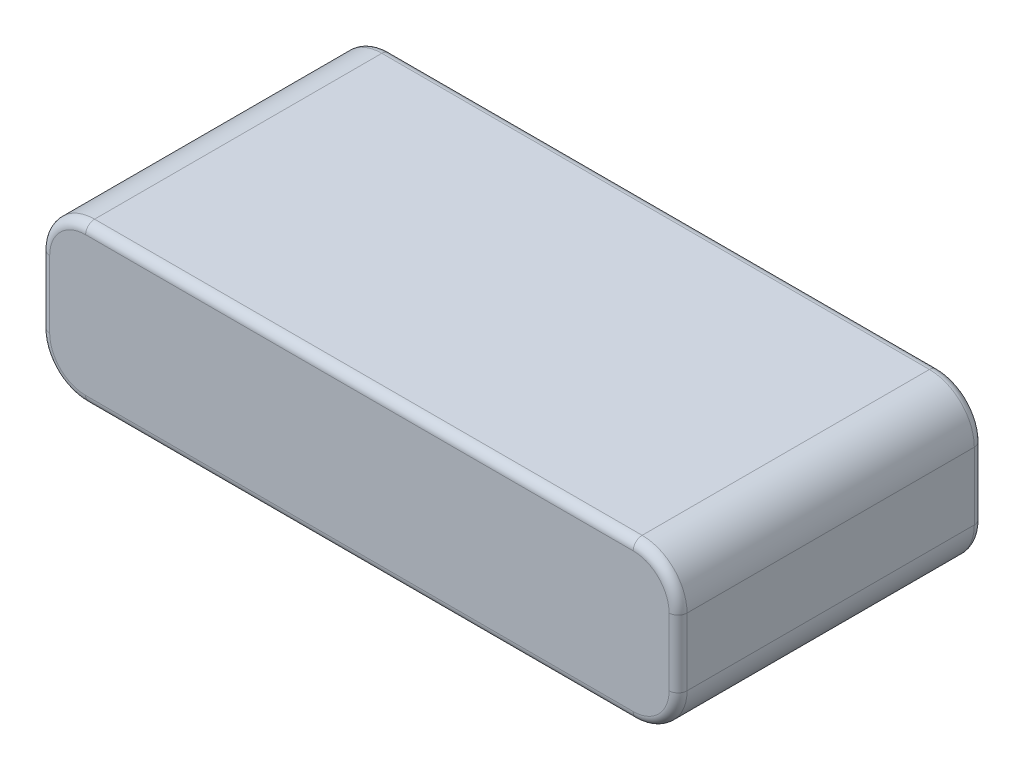
ISO-10303-21;
HEADER;
FILE_DESCRIPTION(('STEP AP214'),'2;1');
FILE_NAME('part.step','',(''),(''),'','','');
FILE_SCHEMA(('AUTOMOTIVE_DESIGN { 1 0 10303 214 1 1 1 1 }'));
ENDSEC;
DATA;
#1=APPLICATION_CONTEXT('core data for automotive mechanical design processes');
#2=APPLICATION_PROTOCOL_DEFINITION('international standard','automotive_design',2000,#1);
#3=PRODUCT_CONTEXT('',#1,'mechanical');
#4=PRODUCT('Part','Part','',(#3));
#5=PRODUCT_RELATED_PRODUCT_CATEGORY('part','',(#4));
#6=PRODUCT_DEFINITION_FORMATION('','',#4);
#7=PRODUCT_DEFINITION_CONTEXT('part definition',#1,'design');
#8=PRODUCT_DEFINITION('design','',#6,#7);
#9=PRODUCT_DEFINITION_SHAPE('','',#8);
#10=(LENGTH_UNIT() NAMED_UNIT(*) SI_UNIT(.MILLI.,.METRE.));
#11=(NAMED_UNIT(*) PLANE_ANGLE_UNIT() SI_UNIT($,.RADIAN.));
#12=(NAMED_UNIT(*) SI_UNIT($,.STERADIAN.) SOLID_ANGLE_UNIT());
#13=UNCERTAINTY_MEASURE_WITH_UNIT(LENGTH_MEASURE(1.E-05),#10,'distance_accuracy_value','');
#14=(GEOMETRIC_REPRESENTATION_CONTEXT(3) GLOBAL_UNCERTAINTY_ASSIGNED_CONTEXT((#13)) GLOBAL_UNIT_ASSIGNED_CONTEXT((#10,
#11,#12)) REPRESENTATION_CONTEXT('',''));
#15=CARTESIAN_POINT('',(0.,0.,0.));
#16=DIRECTION('',(0.,0.,1.));
#17=DIRECTION('',(1.,0.,0.));
#18=AXIS2_PLACEMENT_3D('',#15,#16,#17);
#19=CARTESIAN_POINT('',(35.5,17.5,-17.));
#20=DIRECTION('',(-1.,0.,0.));
#21=DIRECTION('',(0.,0.,1.));
#22=AXIS2_PLACEMENT_3D('',#19,#20,#21);
#23=PLANE('',#22);
#24=DIRECTION('',(0.,0.,-1.));
#25=VECTOR('',#24,1.);
#26=CARTESIAN_POINT('',(35.5,12.5,17.));
#27=LINE('',#26,#25);
#28=CARTESIAN_POINT('',(35.5,12.5,-16.));
#29=VERTEX_POINT('',#28);
#30=CARTESIAN_POINT('',(35.5,12.5,16.));
#31=VERTEX_POINT('',#30);
#32=EDGE_CURVE('E337',#29,#31,#27,.F.);
#33=ORIENTED_EDGE('',*,*,#32,.T.);
#34=DIRECTION('',(0.,-1.,0.));
#35=VECTOR('',#34,1.);
#36=CARTESIAN_POINT('',(35.5,17.5,16.));
#37=LINE('',#36,#35);
#38=CARTESIAN_POINT('',(35.5,5.,16.));
#39=VERTEX_POINT('',#38);
#40=EDGE_CURVE('E239',#31,#39,#37,.T.);
#41=ORIENTED_EDGE('',*,*,#40,.T.);
#42=DIRECTION('',(0.,0.,-1.));
#43=VECTOR('',#42,1.);
#44=CARTESIAN_POINT('',(35.5,5.,-17.));
#45=LINE('',#44,#43);
#46=CARTESIAN_POINT('',(35.5,5.,-16.));
#47=VERTEX_POINT('',#46);
#48=EDGE_CURVE('E330',#39,#47,#45,.T.);
#49=ORIENTED_EDGE('',*,*,#48,.T.);
#50=DIRECTION('',(0.,-1.,0.));
#51=VECTOR('',#50,1.);
#52=CARTESIAN_POINT('',(35.5,17.5,-16.));
#53=LINE('',#52,#51);
#54=EDGE_CURVE('E236',#47,#29,#53,.F.);
#55=ORIENTED_EDGE('',*,*,#54,.T.);
#56=EDGE_LOOP('',(#33,#41,#49,#55));
#57=FACE_BOUND('',#56,.T.);
#58=ADVANCED_FACE('F45',(#57),#23,.F.);
#59=CARTESIAN_POINT('',(-35.5,17.5,-17.));
#60=DIRECTION('',(0.,0.,1.));
#61=DIRECTION('',(1.,0.,0.));
#62=AXIS2_PLACEMENT_3D('',#59,#60,#61);
#63=PLANE('',#62);
#64=DIRECTION('',(0.,-1.,0.));
#65=VECTOR('',#64,1.);
#66=CARTESIAN_POINT('',(-34.5,17.5,-17.));
#67=LINE('',#66,#65);
#68=CARTESIAN_POINT('',(-34.5,5.,-17.));
#69=VERTEX_POINT('',#68);
#70=CARTESIAN_POINT('',(-34.5,12.5,-17.));
#71=VERTEX_POINT('',#70);
#72=EDGE_CURVE('E55',#69,#71,#67,.F.);
#73=ORIENTED_EDGE('',*,*,#72,.T.);
#74=CARTESIAN_POINT('',(-30.5,12.5,-17.));
#75=DIRECTION('',(0.,0.,1.));
#76=DIRECTION('',(1.,0.,0.));
#77=AXIS2_PLACEMENT_3D('',#74,#75,#76);
#78=CIRCLE('',#77,4.);
#79=CARTESIAN_POINT('',(-30.5,16.5,-17.));
#80=VERTEX_POINT('',#79);
#81=EDGE_CURVE('E11',#71,#80,#78,.F.);
#82=ORIENTED_EDGE('',*,*,#81,.T.);
#83=DIRECTION('',(-1.,0.,0.));
#84=VECTOR('',#83,1.);
#85=CARTESIAN_POINT('',(30.5,16.5,-17.));
#86=LINE('',#85,#84);
#87=CARTESIAN_POINT('',(30.5,16.5,-17.));
#88=VERTEX_POINT('',#87);
#89=EDGE_CURVE('E242',#80,#88,#86,.F.);
#90=ORIENTED_EDGE('',*,*,#89,.T.);
#91=CARTESIAN_POINT('',(30.5,12.5,-17.));
#92=DIRECTION('',(0.,0.,1.));
#93=DIRECTION('',(1.,0.,0.));
#94=AXIS2_PLACEMENT_3D('',#91,#92,#93);
#95=CIRCLE('',#94,4.);
#96=CARTESIAN_POINT('',(34.5,12.5,-17.));
#97=VERTEX_POINT('',#96);
#98=EDGE_CURVE('E245',#88,#97,#95,.F.);
#99=ORIENTED_EDGE('',*,*,#98,.T.);
#100=DIRECTION('',(0.,-1.,0.));
#101=VECTOR('',#100,1.);
#102=CARTESIAN_POINT('',(34.5,17.5,-17.));
#103=LINE('',#102,#101);
#104=CARTESIAN_POINT('',(34.5,5.,-17.));
#105=VERTEX_POINT('',#104);
#106=EDGE_CURVE('E248',#97,#105,#103,.T.);
#107=ORIENTED_EDGE('',*,*,#106,.T.);
#108=CARTESIAN_POINT('',(30.5,5.,-17.));
#109=DIRECTION('',(0.,0.,1.));
#110=DIRECTION('',(1.,0.,0.));
#111=AXIS2_PLACEMENT_3D('',#108,#109,#110);
#112=CIRCLE('',#111,4.);
#113=CARTESIAN_POINT('',(30.5,1.,-17.));
#114=VERTEX_POINT('',#113);
#115=EDGE_CURVE('E251',#105,#114,#112,.F.);
#116=ORIENTED_EDGE('',*,*,#115,.T.);
#117=DIRECTION('',(-1.,0.,0.));
#118=VECTOR('',#117,1.);
#119=CARTESIAN_POINT('',(-35.5,1.,-17.));
#120=LINE('',#119,#118);
#121=CARTESIAN_POINT('',(-30.5,1.,-17.));
#122=VERTEX_POINT('',#121);
#123=EDGE_CURVE('E254',#114,#122,#120,.T.);
#124=ORIENTED_EDGE('',*,*,#123,.T.);
#125=CARTESIAN_POINT('',(-30.5,5.,-17.));
#126=DIRECTION('',(0.,0.,1.));
#127=DIRECTION('',(1.,0.,0.));
#128=AXIS2_PLACEMENT_3D('',#125,#126,#127);
#129=CIRCLE('',#128,4.);
#130=EDGE_CURVE('E66',#122,#69,#129,.F.);
#131=ORIENTED_EDGE('',*,*,#130,.T.);
#132=EDGE_LOOP('',(#73,#82,#90,#99,#107,#116,#124,#131));
#133=FACE_BOUND('',#132,.T.);
#134=ADVANCED_FACE('F399',(#133),#63,.F.);
#135=CARTESIAN_POINT('',(-35.5,17.5,-17.));
#136=DIRECTION('',(1.,0.,0.));
#137=DIRECTION('',(0.,0.,-1.));
#138=AXIS2_PLACEMENT_3D('',#135,#136,#137);
#139=PLANE('',#138);
#140=DIRECTION('',(0.,0.,1.));
#141=VECTOR('',#140,1.);
#142=CARTESIAN_POINT('',(-35.5,5.,-17.));
#143=LINE('',#142,#141);
#144=CARTESIAN_POINT('',(-35.5,5.,-16.));
#145=VERTEX_POINT('',#144);
#146=CARTESIAN_POINT('',(-35.5,5.,16.));
#147=VERTEX_POINT('',#146);
#148=EDGE_CURVE('E181',#145,#147,#143,.T.);
#149=ORIENTED_EDGE('',*,*,#148,.T.);
#150=DIRECTION('',(0.,-1.,0.));
#151=VECTOR('',#150,1.);
#152=CARTESIAN_POINT('',(-35.5,17.5,16.));
#153=LINE('',#152,#151);
#154=CARTESIAN_POINT('',(-35.5,12.5,16.));
#155=VERTEX_POINT('',#154);
#156=EDGE_CURVE('E214',#147,#155,#153,.F.);
#157=ORIENTED_EDGE('',*,*,#156,.T.);
#158=DIRECTION('',(0.,0.,1.));
#159=VECTOR('',#158,1.);
#160=CARTESIAN_POINT('',(-35.5,12.5,-17.));
#161=LINE('',#160,#159);
#162=CARTESIAN_POINT('',(-35.5,12.5,-16.));
#163=VERTEX_POINT('',#162);
#164=EDGE_CURVE('E353',#155,#163,#161,.F.);
#165=ORIENTED_EDGE('',*,*,#164,.T.);
#166=DIRECTION('',(0.,-1.,0.));
#167=VECTOR('',#166,1.);
#168=CARTESIAN_POINT('',(-35.5,17.5,-16.));
#169=LINE('',#168,#167);
#170=EDGE_CURVE('E211',#163,#145,#169,.T.);
#171=ORIENTED_EDGE('',*,*,#170,.T.);
#172=EDGE_LOOP('',(#149,#157,#165,#171));
#173=FACE_BOUND('',#172,.T.);
#174=ADVANCED_FACE('F429',(#173),#139,.F.);
#175=CARTESIAN_POINT('',(-35.5,17.5,17.));
#176=DIRECTION('',(0.,0.,-1.));
#177=DIRECTION('',(-1.,0.,0.));
#178=AXIS2_PLACEMENT_3D('',#175,#176,#177);
#179=PLANE('',#178);
#180=DIRECTION('',(1.,0.,0.));
#181=VECTOR('',#180,1.);
#182=CARTESIAN_POINT('',(-35.5,1.,17.));
#183=LINE('',#182,#181);
#184=CARTESIAN_POINT('',(-30.5,1.,17.));
#185=VERTEX_POINT('',#184);
#186=CARTESIAN_POINT('',(30.5,1.,17.));
#187=VERTEX_POINT('',#186);
#188=EDGE_CURVE('E185',#185,#187,#183,.T.);
#189=ORIENTED_EDGE('',*,*,#188,.T.);
#190=CARTESIAN_POINT('',(30.5,5.,17.));
#191=DIRECTION('',(0.,0.,-1.));
#192=DIRECTION('',(-1.,0.,0.));
#193=AXIS2_PLACEMENT_3D('',#190,#191,#192);
#194=CIRCLE('',#193,4.);
#195=CARTESIAN_POINT('',(34.5,5.,17.));
#196=VERTEX_POINT('',#195);
#197=EDGE_CURVE('E164',#187,#196,#194,.F.);
#198=ORIENTED_EDGE('',*,*,#197,.T.);
#199=DIRECTION('',(0.,-1.,0.));
#200=VECTOR('',#199,1.);
#201=CARTESIAN_POINT('',(34.5,17.5,17.));
#202=LINE('',#201,#200);
#203=CARTESIAN_POINT('',(34.5,12.5,17.));
#204=VERTEX_POINT('',#203);
#205=EDGE_CURVE('E173',#196,#204,#202,.F.);
#206=ORIENTED_EDGE('',*,*,#205,.T.);
#207=CARTESIAN_POINT('',(30.5,12.5,17.));
#208=DIRECTION('',(0.,0.,-1.));
#209=DIRECTION('',(-1.,0.,0.));
#210=AXIS2_PLACEMENT_3D('',#207,#208,#209);
#211=CIRCLE('',#210,4.);
#212=CARTESIAN_POINT('',(30.5,16.5,17.));
#213=VERTEX_POINT('',#212);
#214=EDGE_CURVE('E180',#204,#213,#211,.F.);
#215=ORIENTED_EDGE('',*,*,#214,.T.);
#216=DIRECTION('',(1.,0.,0.));
#217=VECTOR('',#216,1.);
#218=CARTESIAN_POINT('',(-30.5,16.5,17.));
#219=LINE('',#218,#217);
#220=CARTESIAN_POINT('',(-30.5,16.5,17.));
#221=VERTEX_POINT('',#220);
#222=EDGE_CURVE('E362',#213,#221,#219,.F.);
#223=ORIENTED_EDGE('',*,*,#222,.T.);
#224=CARTESIAN_POINT('',(-30.5,12.5,17.));
#225=DIRECTION('',(0.,0.,-1.));
#226=DIRECTION('',(-1.,0.,0.));
#227=AXIS2_PLACEMENT_3D('',#224,#225,#226);
#228=CIRCLE('',#227,4.);
#229=CARTESIAN_POINT('',(-34.5,12.5,17.));
#230=VERTEX_POINT('',#229);
#231=EDGE_CURVE('E365',#221,#230,#228,.F.);
#232=ORIENTED_EDGE('',*,*,#231,.T.);
#233=DIRECTION('',(0.,-1.,0.));
#234=VECTOR('',#233,1.);
#235=CARTESIAN_POINT('',(-34.5,17.5,17.));
#236=LINE('',#235,#234);
#237=CARTESIAN_POINT('',(-34.5,5.,17.));
#238=VERTEX_POINT('',#237);
#239=EDGE_CURVE('E368',#230,#238,#236,.T.);
#240=ORIENTED_EDGE('',*,*,#239,.T.);
#241=CARTESIAN_POINT('',(-30.5,5.,17.));
#242=DIRECTION('',(0.,0.,-1.));
#243=DIRECTION('',(-1.,0.,0.));
#244=AXIS2_PLACEMENT_3D('',#241,#242,#243);
#245=CIRCLE('',#244,4.);
#246=EDGE_CURVE('E193',#238,#185,#245,.F.);
#247=ORIENTED_EDGE('',*,*,#246,.T.);
#248=EDGE_LOOP('',(#189,#198,#206,#215,#223,#232,#240,#247));
#249=FACE_BOUND('',#248,.T.);
#250=ADVANCED_FACE('F183',(#249),#179,.F.);
#251=CARTESIAN_POINT('',(0.,17.5,0.));
#252=DIRECTION('',(0.,1.,0.));
#253=DIRECTION('',(0.,0.,1.));
#254=AXIS2_PLACEMENT_3D('',#251,#252,#253);
#255=PLANE('',#254);
#256=DIRECTION('',(0.,0.,1.));
#257=VECTOR('',#256,1.);
#258=CARTESIAN_POINT('',(-30.5,17.5,17.));
#259=LINE('',#258,#257);
#260=CARTESIAN_POINT('',(-30.5,17.5,-16.));
#261=VERTEX_POINT('',#260);
#262=CARTESIAN_POINT('',(-30.5,17.5,16.));
#263=VERTEX_POINT('',#262);
#264=EDGE_CURVE('E285',#261,#263,#259,.T.);
#265=ORIENTED_EDGE('',*,*,#264,.T.);
#266=DIRECTION('',(1.,0.,0.));
#267=VECTOR('',#266,1.);
#268=CARTESIAN_POINT('',(30.5,17.5,16.));
#269=LINE('',#268,#267);
#270=CARTESIAN_POINT('',(30.5,17.5,16.));
#271=VERTEX_POINT('',#270);
#272=EDGE_CURVE('E227',#263,#271,#269,.T.);
#273=ORIENTED_EDGE('',*,*,#272,.T.);
#274=DIRECTION('',(0.,0.,-1.));
#275=VECTOR('',#274,1.);
#276=CARTESIAN_POINT('',(30.5,17.5,-17.));
#277=LINE('',#276,#275);
#278=CARTESIAN_POINT('',(30.5,17.5,-16.));
#279=VERTEX_POINT('',#278);
#280=EDGE_CURVE('E338',#271,#279,#277,.T.);
#281=ORIENTED_EDGE('',*,*,#280,.T.);
#282=DIRECTION('',(-1.,0.,0.));
#283=VECTOR('',#282,1.);
#284=CARTESIAN_POINT('',(-30.5,17.5,-16.));
#285=LINE('',#284,#283);
#286=EDGE_CURVE('E224',#279,#261,#285,.T.);
#287=ORIENTED_EDGE('',*,*,#286,.T.);
#288=EDGE_LOOP('',(#265,#273,#281,#287));
#289=FACE_BOUND('',#288,.T.);
#290=ADVANCED_FACE('F412',(#289),#255,.T.);
#291=CARTESIAN_POINT('',(0.,0.,0.));
#292=DIRECTION('',(0.,1.,0.));
#293=DIRECTION('',(0.,0.,1.));
#294=AXIS2_PLACEMENT_3D('',#291,#292,#293);
#295=PLANE('',#294);
#296=DIRECTION('',(0.,0.,-1.));
#297=VECTOR('',#296,1.);
#298=CARTESIAN_POINT('',(30.5,0.,0.));
#299=LINE('',#298,#297);
#300=CARTESIAN_POINT('',(30.5,0.,-16.));
#301=VERTEX_POINT('',#300);
#302=CARTESIAN_POINT('',(30.5,0.,16.));
#303=VERTEX_POINT('',#302);
#304=EDGE_CURVE('E332',#301,#303,#299,.F.);
#305=ORIENTED_EDGE('',*,*,#304,.T.);
#306=DIRECTION('',(1.,0.,0.));
#307=VECTOR('',#306,1.);
#308=CARTESIAN_POINT('',(0.,0.,16.));
#309=LINE('',#308,#307);
#310=CARTESIAN_POINT('',(-30.5,0.,16.));
#311=VERTEX_POINT('',#310);
#312=EDGE_CURVE('E202',#303,#311,#309,.F.);
#313=ORIENTED_EDGE('',*,*,#312,.T.);
#314=DIRECTION('',(0.,0.,1.));
#315=VECTOR('',#314,1.);
#316=CARTESIAN_POINT('',(-30.5,0.,0.));
#317=LINE('',#316,#315);
#318=CARTESIAN_POINT('',(-30.5,0.,-16.));
#319=VERTEX_POINT('',#318);
#320=EDGE_CURVE('E342',#311,#319,#317,.F.);
#321=ORIENTED_EDGE('',*,*,#320,.T.);
#322=DIRECTION('',(-1.,0.,0.));
#323=VECTOR('',#322,1.);
#324=CARTESIAN_POINT('',(0.,0.,-16.));
#325=LINE('',#324,#323);
#326=EDGE_CURVE('E199',#319,#301,#325,.F.);
#327=ORIENTED_EDGE('',*,*,#326,.T.);
#328=EDGE_LOOP('',(#305,#313,#321,#327));
#329=FACE_BOUND('',#328,.T.);
#330=ADVANCED_FACE('F383',(#329),#295,.F.);
#331=CARTESIAN_POINT('',(30.5,12.5,0.));
#332=DIRECTION('',(0.,0.,1.));
#333=DIRECTION('',(1.,0.,0.));
#334=AXIS2_PLACEMENT_3D('',#331,#332,#333);
#335=CYLINDRICAL_SURFACE('',#334,5.);
#336=ORIENTED_EDGE('',*,*,#280,.F.);
#337=CARTESIAN_POINT('',(30.5,12.5,16.));
#338=DIRECTION('',(0.,0.,-1.));
#339=DIRECTION('',(-1.,0.,0.));
#340=AXIS2_PLACEMENT_3D('',#337,#338,#339);
#341=CIRCLE('',#340,5.);
#342=EDGE_CURVE('E233',#271,#31,#341,.T.);
#343=ORIENTED_EDGE('',*,*,#342,.T.);
#344=ORIENTED_EDGE('',*,*,#32,.F.);
#345=CARTESIAN_POINT('',(30.5,12.5,-16.));
#346=DIRECTION('',(0.,0.,1.));
#347=DIRECTION('',(1.,0.,0.));
#348=AXIS2_PLACEMENT_3D('',#345,#346,#347);
#349=CIRCLE('',#348,5.);
#350=EDGE_CURVE('E230',#29,#279,#349,.T.);
#351=ORIENTED_EDGE('',*,*,#350,.T.);
#352=EDGE_LOOP('',(#336,#343,#344,#351));
#353=FACE_BOUND('',#352,.T.);
#354=ADVANCED_FACE('F443',(#353),#335,.T.);
#355=CARTESIAN_POINT('',(30.5,5.,-17.));
#356=DIRECTION('',(0.,0.,-1.));
#357=DIRECTION('',(-1.,0.,0.));
#358=AXIS2_PLACEMENT_3D('',#355,#356,#357);
#359=CYLINDRICAL_SURFACE('',#358,5.);
#360=ORIENTED_EDGE('',*,*,#48,.F.);
#361=CARTESIAN_POINT('',(30.5,5.,16.));
#362=DIRECTION('',(0.,0.,-1.));
#363=DIRECTION('',(-1.,0.,0.));
#364=AXIS2_PLACEMENT_3D('',#361,#362,#363);
#365=CIRCLE('',#364,5.);
#366=EDGE_CURVE('E166',#39,#303,#365,.T.);
#367=ORIENTED_EDGE('',*,*,#366,.T.);
#368=ORIENTED_EDGE('',*,*,#304,.F.);
#369=CARTESIAN_POINT('',(30.5,5.,-16.));
#370=DIRECTION('',(0.,0.,1.));
#371=DIRECTION('',(1.,0.,0.));
#372=AXIS2_PLACEMENT_3D('',#369,#370,#371);
#373=CIRCLE('',#372,5.);
#374=EDGE_CURVE('E188',#301,#47,#373,.T.);
#375=ORIENTED_EDGE('',*,*,#374,.T.);
#376=EDGE_LOOP('',(#360,#367,#368,#375));
#377=FACE_BOUND('',#376,.T.);
#378=ADVANCED_FACE('F329',(#377),#359,.T.);
#379=CARTESIAN_POINT('',(-30.5,5.,-17.));
#380=DIRECTION('',(0.,0.,1.));
#381=DIRECTION('',(1.,0.,0.));
#382=AXIS2_PLACEMENT_3D('',#379,#380,#381);
#383=CYLINDRICAL_SURFACE('',#382,5.);
#384=ORIENTED_EDGE('',*,*,#320,.F.);
#385=CARTESIAN_POINT('',(-30.5,5.,16.));
#386=DIRECTION('',(0.,0.,-1.));
#387=DIRECTION('',(-1.,0.,0.));
#388=AXIS2_PLACEMENT_3D('',#385,#386,#387);
#389=CIRCLE('',#388,5.);
#390=EDGE_CURVE('E208',#311,#147,#389,.T.);
#391=ORIENTED_EDGE('',*,*,#390,.T.);
#392=ORIENTED_EDGE('',*,*,#148,.F.);
#393=CARTESIAN_POINT('',(-30.5,5.,-16.));
#394=DIRECTION('',(0.,0.,1.));
#395=DIRECTION('',(1.,0.,0.));
#396=AXIS2_PLACEMENT_3D('',#393,#394,#395);
#397=CIRCLE('',#396,5.);
#398=EDGE_CURVE('E205',#145,#319,#397,.T.);
#399=ORIENTED_EDGE('',*,*,#398,.T.);
#400=EDGE_LOOP('',(#384,#391,#392,#399));
#401=FACE_BOUND('',#400,.T.);
#402=ADVANCED_FACE('F385',(#401),#383,.T.);
#403=CARTESIAN_POINT('',(-30.5,12.5,0.));
#404=DIRECTION('',(0.,0.,-1.));
#405=DIRECTION('',(-1.,0.,0.));
#406=AXIS2_PLACEMENT_3D('',#403,#404,#405);
#407=CYLINDRICAL_SURFACE('',#406,5.);
#408=ORIENTED_EDGE('',*,*,#164,.F.);
#409=CARTESIAN_POINT('',(-30.5,12.5,16.));
#410=DIRECTION('',(0.,0.,-1.));
#411=DIRECTION('',(-1.,0.,0.));
#412=AXIS2_PLACEMENT_3D('',#409,#410,#411);
#413=CIRCLE('',#412,5.);
#414=EDGE_CURVE('E221',#155,#263,#413,.T.);
#415=ORIENTED_EDGE('',*,*,#414,.T.);
#416=ORIENTED_EDGE('',*,*,#264,.F.);
#417=CARTESIAN_POINT('',(-30.5,12.5,-16.));
#418=DIRECTION('',(0.,0.,1.));
#419=DIRECTION('',(1.,0.,0.));
#420=AXIS2_PLACEMENT_3D('',#417,#418,#419);
#421=CIRCLE('',#420,5.);
#422=EDGE_CURVE('E217',#261,#163,#421,.T.);
#423=ORIENTED_EDGE('',*,*,#422,.T.);
#424=EDGE_LOOP('',(#408,#415,#416,#423));
#425=FACE_BOUND('',#424,.T.);
#426=ADVANCED_FACE('F417',(#425),#407,.T.);
#427=CARTESIAN_POINT('',(-30.5,12.5,16.));
#428=DIRECTION('',(0.,0.,-1.));
#429=DIRECTION('',(-1.,0.,0.));
#430=AXIS2_PLACEMENT_3D('',#427,#428,#429);
#431=TOROIDAL_SURFACE('',#430,4.,1.);
#432=CARTESIAN_POINT('',(-30.5,16.5,16.));
#433=DIRECTION('',(1.,0.,0.));
#434=DIRECTION('',(0.,0.,-1.));
#435=AXIS2_PLACEMENT_3D('',#432,#433,#434);
#436=CIRCLE('',#435,1.);
#437=EDGE_CURVE('E277',#263,#221,#436,.T.);
#438=ORIENTED_EDGE('',*,*,#437,.F.);
#439=ORIENTED_EDGE('',*,*,#414,.F.);
#440=CARTESIAN_POINT('',(-34.5,12.5,16.));
#441=DIRECTION('',(0.,-1.,0.));
#442=DIRECTION('',(0.,0.,-1.));
#443=AXIS2_PLACEMENT_3D('',#440,#441,#442);
#444=CIRCLE('',#443,1.);
#445=EDGE_CURVE('E281',#230,#155,#444,.T.);
#446=ORIENTED_EDGE('',*,*,#445,.F.);
#447=ORIENTED_EDGE('',*,*,#231,.F.);
#448=EDGE_LOOP('',(#438,#439,#446,#447));
#449=FACE_BOUND('',#448,.T.);
#450=ADVANCED_FACE('F422',(#449),#431,.T.);
#451=CARTESIAN_POINT('',(-34.5,17.5,16.));
#452=DIRECTION('',(0.,-1.,0.));
#453=DIRECTION('',(0.,0.,-1.));
#454=AXIS2_PLACEMENT_3D('',#451,#452,#453);
#455=CYLINDRICAL_SURFACE('',#454,1.);
#456=ORIENTED_EDGE('',*,*,#445,.T.);
#457=ORIENTED_EDGE('',*,*,#156,.F.);
#458=CARTESIAN_POINT('',(-34.5,5.,16.));
#459=DIRECTION('',(0.,-1.,0.));
#460=DIRECTION('',(0.,0.,-1.));
#461=AXIS2_PLACEMENT_3D('',#458,#459,#460);
#462=CIRCLE('',#461,1.);
#463=EDGE_CURVE('E273',#238,#147,#462,.T.);
#464=ORIENTED_EDGE('',*,*,#463,.F.);
#465=ORIENTED_EDGE('',*,*,#239,.F.);
#466=EDGE_LOOP('',(#456,#457,#464,#465));
#467=FACE_BOUND('',#466,.T.);
#468=ADVANCED_FACE('F427',(#467),#455,.T.);
#469=CARTESIAN_POINT('',(0.,16.5,16.));
#470=DIRECTION('',(-1.,0.,0.));
#471=DIRECTION('',(0.,0.,1.));
#472=AXIS2_PLACEMENT_3D('',#469,#470,#471);
#473=CYLINDRICAL_SURFACE('',#472,1.);
#474=ORIENTED_EDGE('',*,*,#437,.T.);
#475=ORIENTED_EDGE('',*,*,#222,.F.);
#476=CARTESIAN_POINT('',(30.5,16.5,16.));
#477=DIRECTION('',(1.,0.,0.));
#478=DIRECTION('',(0.,0.,-1.));
#479=AXIS2_PLACEMENT_3D('',#476,#477,#478);
#480=CIRCLE('',#479,1.);
#481=EDGE_CURVE('E269',#271,#213,#480,.T.);
#482=ORIENTED_EDGE('',*,*,#481,.F.);
#483=ORIENTED_EDGE('',*,*,#272,.F.);
#484=EDGE_LOOP('',(#474,#475,#482,#483));
#485=FACE_BOUND('',#484,.T.);
#486=ADVANCED_FACE('F465',(#485),#473,.T.);
#487=CARTESIAN_POINT('',(-30.5,5.,16.));
#488=DIRECTION('',(0.,0.,-1.));
#489=DIRECTION('',(-1.,0.,0.));
#490=AXIS2_PLACEMENT_3D('',#487,#488,#489);
#491=TOROIDAL_SURFACE('',#490,4.,1.);
#492=ORIENTED_EDGE('',*,*,#463,.T.);
#493=ORIENTED_EDGE('',*,*,#390,.F.);
#494=CARTESIAN_POINT('',(-30.5,1.,16.));
#495=DIRECTION('',(1.,0.,0.));
#496=DIRECTION('',(0.,0.,-1.));
#497=AXIS2_PLACEMENT_3D('',#494,#495,#496);
#498=CIRCLE('',#497,1.);
#499=EDGE_CURVE('E265',#185,#311,#498,.T.);
#500=ORIENTED_EDGE('',*,*,#499,.F.);
#501=ORIENTED_EDGE('',*,*,#246,.F.);
#502=EDGE_LOOP('',(#492,#493,#500,#501));
#503=FACE_BOUND('',#502,.T.);
#504=ADVANCED_FACE('F377',(#503),#491,.T.);
#505=CARTESIAN_POINT('',(30.5,12.5,16.));
#506=DIRECTION('',(0.,0.,-1.));
#507=DIRECTION('',(-1.,0.,0.));
#508=AXIS2_PLACEMENT_3D('',#505,#506,#507);
#509=TOROIDAL_SURFACE('',#508,4.,1.);
#510=ORIENTED_EDGE('',*,*,#481,.T.);
#511=ORIENTED_EDGE('',*,*,#214,.F.);
#512=CARTESIAN_POINT('',(34.5,12.5,16.));
#513=DIRECTION('',(0.,-1.,0.));
#514=DIRECTION('',(0.,0.,-1.));
#515=AXIS2_PLACEMENT_3D('',#512,#513,#514);
#516=CIRCLE('',#515,1.);
#517=EDGE_CURVE('E176',#31,#204,#516,.T.);
#518=ORIENTED_EDGE('',*,*,#517,.F.);
#519=ORIENTED_EDGE('',*,*,#342,.F.);
#520=EDGE_LOOP('',(#510,#511,#518,#519));
#521=FACE_BOUND('',#520,.T.);
#522=ADVANCED_FACE('F459',(#521),#509,.T.);
#523=CARTESIAN_POINT('',(-35.5,1.,16.));
#524=DIRECTION('',(1.,0.,0.));
#525=DIRECTION('',(0.,0.,-1.));
#526=AXIS2_PLACEMENT_3D('',#523,#524,#525);
#527=CYLINDRICAL_SURFACE('',#526,1.);
#528=ORIENTED_EDGE('',*,*,#499,.T.);
#529=ORIENTED_EDGE('',*,*,#312,.F.);
#530=CARTESIAN_POINT('',(30.5,1.,16.));
#531=DIRECTION('',(1.,0.,0.));
#532=DIRECTION('',(0.,0.,-1.));
#533=AXIS2_PLACEMENT_3D('',#530,#531,#532);
#534=CIRCLE('',#533,1.);
#535=EDGE_CURVE('E170',#187,#303,#534,.T.);
#536=ORIENTED_EDGE('',*,*,#535,.F.);
#537=ORIENTED_EDGE('',*,*,#188,.F.);
#538=EDGE_LOOP('',(#528,#529,#536,#537));
#539=FACE_BOUND('',#538,.T.);
#540=ADVANCED_FACE('F380',(#539),#527,.T.);
#541=CARTESIAN_POINT('',(34.5,17.5,16.));
#542=DIRECTION('',(0.,-1.,0.));
#543=DIRECTION('',(0.,0.,-1.));
#544=AXIS2_PLACEMENT_3D('',#541,#542,#543);
#545=CYLINDRICAL_SURFACE('',#544,1.);
#546=ORIENTED_EDGE('',*,*,#517,.T.);
#547=ORIENTED_EDGE('',*,*,#205,.F.);
#548=CARTESIAN_POINT('',(34.5,5.,16.));
#549=DIRECTION('',(0.,-1.,0.));
#550=DIRECTION('',(0.,0.,-1.));
#551=AXIS2_PLACEMENT_3D('',#548,#549,#550);
#552=CIRCLE('',#551,1.);
#553=EDGE_CURVE('E160',#39,#196,#552,.T.);
#554=ORIENTED_EDGE('',*,*,#553,.F.);
#555=ORIENTED_EDGE('',*,*,#40,.F.);
#556=EDGE_LOOP('',(#546,#547,#554,#555));
#557=FACE_BOUND('',#556,.T.);
#558=ADVANCED_FACE('F174',(#557),#545,.T.);
#559=CARTESIAN_POINT('',(30.5,5.,16.));
#560=DIRECTION('',(0.,0.,-1.));
#561=DIRECTION('',(-1.,0.,0.));
#562=AXIS2_PLACEMENT_3D('',#559,#560,#561);
#563=TOROIDAL_SURFACE('',#562,4.,1.);
#564=ORIENTED_EDGE('',*,*,#535,.T.);
#565=ORIENTED_EDGE('',*,*,#366,.F.);
#566=ORIENTED_EDGE('',*,*,#553,.T.);
#567=ORIENTED_EDGE('',*,*,#197,.F.);
#568=EDGE_LOOP('',(#564,#565,#566,#567));
#569=FACE_BOUND('',#568,.T.);
#570=ADVANCED_FACE('F162',(#569),#563,.T.);
#571=CARTESIAN_POINT('',(30.5,5.,-16.));
#572=DIRECTION('',(0.,0.,1.));
#573=DIRECTION('',(1.,0.,0.));
#574=AXIS2_PLACEMENT_3D('',#571,#572,#573);
#575=TOROIDAL_SURFACE('',#574,4.,1.);
#576=CARTESIAN_POINT('',(34.5,5.,-16.));
#577=DIRECTION('',(0.,1.,0.));
#578=DIRECTION('',(0.,0.,1.));
#579=AXIS2_PLACEMENT_3D('',#576,#577,#578);
#580=CIRCLE('',#579,1.);
#581=EDGE_CURVE('E307',#47,#105,#580,.T.);
#582=ORIENTED_EDGE('',*,*,#581,.F.);
#583=ORIENTED_EDGE('',*,*,#374,.F.);
#584=CARTESIAN_POINT('',(30.5,1.,-16.));
#585=DIRECTION('',(-1.,0.,0.));
#586=DIRECTION('',(0.,0.,1.));
#587=AXIS2_PLACEMENT_3D('',#584,#585,#586);
#588=CIRCLE('',#587,1.);
#589=EDGE_CURVE('E49',#114,#301,#588,.T.);
#590=ORIENTED_EDGE('',*,*,#589,.F.);
#591=ORIENTED_EDGE('',*,*,#115,.F.);
#592=EDGE_LOOP('',(#582,#583,#590,#591));
#593=FACE_BOUND('',#592,.T.);
#594=ADVANCED_FACE('F47',(#593),#575,.T.);
#595=CARTESIAN_POINT('',(-35.5,1.,-16.));
#596=DIRECTION('',(-1.,0.,0.));
#597=DIRECTION('',(0.,0.,1.));
#598=AXIS2_PLACEMENT_3D('',#595,#596,#597);
#599=CYLINDRICAL_SURFACE('',#598,1.);
#600=ORIENTED_EDGE('',*,*,#589,.T.);
#601=ORIENTED_EDGE('',*,*,#326,.F.);
#602=CARTESIAN_POINT('',(-30.5,1.,-16.));
#603=DIRECTION('',(-1.,0.,0.));
#604=DIRECTION('',(0.,0.,1.));
#605=AXIS2_PLACEMENT_3D('',#602,#603,#604);
#606=CIRCLE('',#605,1.);
#607=EDGE_CURVE('E304',#122,#319,#606,.T.);
#608=ORIENTED_EDGE('',*,*,#607,.F.);
#609=ORIENTED_EDGE('',*,*,#123,.F.);
#610=EDGE_LOOP('',(#600,#601,#608,#609));
#611=FACE_BOUND('',#610,.T.);
#612=ADVANCED_FACE('F320',(#611),#599,.T.);
#613=CARTESIAN_POINT('',(34.5,17.5,-16.));
#614=DIRECTION('',(0.,-1.,0.));
#615=DIRECTION('',(0.,0.,-1.));
#616=AXIS2_PLACEMENT_3D('',#613,#614,#615);
#617=CYLINDRICAL_SURFACE('',#616,1.);
#618=ORIENTED_EDGE('',*,*,#581,.T.);
#619=ORIENTED_EDGE('',*,*,#106,.F.);
#620=CARTESIAN_POINT('',(34.5,12.5,-16.));
#621=DIRECTION('',(0.,1.,0.));
#622=DIRECTION('',(0.,0.,1.));
#623=AXIS2_PLACEMENT_3D('',#620,#621,#622);
#624=CIRCLE('',#623,1.);
#625=EDGE_CURVE('E300',#29,#97,#624,.T.);
#626=ORIENTED_EDGE('',*,*,#625,.F.);
#627=ORIENTED_EDGE('',*,*,#54,.F.);
#628=EDGE_LOOP('',(#618,#619,#626,#627));
#629=FACE_BOUND('',#628,.T.);
#630=ADVANCED_FACE('F483',(#629),#617,.T.);
#631=CARTESIAN_POINT('',(-30.5,5.,-16.));
#632=DIRECTION('',(0.,0.,1.));
#633=DIRECTION('',(1.,0.,0.));
#634=AXIS2_PLACEMENT_3D('',#631,#632,#633);
#635=TOROIDAL_SURFACE('',#634,4.,1.);
#636=ORIENTED_EDGE('',*,*,#607,.T.);
#637=ORIENTED_EDGE('',*,*,#398,.F.);
#638=CARTESIAN_POINT('',(-34.5,5.,-16.));
#639=DIRECTION('',(0.,1.,0.));
#640=DIRECTION('',(0.,0.,1.));
#641=AXIS2_PLACEMENT_3D('',#638,#639,#640);
#642=CIRCLE('',#641,1.);
#643=EDGE_CURVE('E296',#69,#145,#642,.T.);
#644=ORIENTED_EDGE('',*,*,#643,.F.);
#645=ORIENTED_EDGE('',*,*,#130,.F.);
#646=EDGE_LOOP('',(#636,#637,#644,#645));
#647=FACE_BOUND('',#646,.T.);
#648=ADVANCED_FACE('F389',(#647),#635,.T.);
#649=CARTESIAN_POINT('',(30.5,12.5,-16.));
#650=DIRECTION('',(0.,0.,1.));
#651=DIRECTION('',(1.,0.,0.));
#652=AXIS2_PLACEMENT_3D('',#649,#650,#651);
#653=TOROIDAL_SURFACE('',#652,4.,1.);
#654=ORIENTED_EDGE('',*,*,#625,.T.);
#655=ORIENTED_EDGE('',*,*,#98,.F.);
#656=CARTESIAN_POINT('',(30.5,16.5,-16.));
#657=DIRECTION('',(-1.,0.,0.));
#658=DIRECTION('',(0.,0.,1.));
#659=AXIS2_PLACEMENT_3D('',#656,#657,#658);
#660=CIRCLE('',#659,1.);
#661=EDGE_CURVE('E292',#279,#88,#660,.T.);
#662=ORIENTED_EDGE('',*,*,#661,.F.);
#663=ORIENTED_EDGE('',*,*,#350,.F.);
#664=EDGE_LOOP('',(#654,#655,#662,#663));
#665=FACE_BOUND('',#664,.T.);
#666=ADVANCED_FACE('F404',(#665),#653,.T.);
#667=CARTESIAN_POINT('',(-34.5,17.5,-16.));
#668=DIRECTION('',(0.,-1.,0.));
#669=DIRECTION('',(0.,0.,-1.));
#670=AXIS2_PLACEMENT_3D('',#667,#668,#669);
#671=CYLINDRICAL_SURFACE('',#670,1.);
#672=ORIENTED_EDGE('',*,*,#643,.T.);
#673=ORIENTED_EDGE('',*,*,#170,.F.);
#674=CARTESIAN_POINT('',(-34.5,12.5,-16.));
#675=DIRECTION('',(0.,1.,0.));
#676=DIRECTION('',(0.,0.,1.));
#677=AXIS2_PLACEMENT_3D('',#674,#675,#676);
#678=CIRCLE('',#677,1.);
#679=EDGE_CURVE('E289',#71,#163,#678,.T.);
#680=ORIENTED_EDGE('',*,*,#679,.F.);
#681=ORIENTED_EDGE('',*,*,#72,.F.);
#682=EDGE_LOOP('',(#672,#673,#680,#681));
#683=FACE_BOUND('',#682,.T.);
#684=ADVANCED_FACE('F392',(#683),#671,.T.);
#685=CARTESIAN_POINT('',(0.,16.5,-16.));
#686=DIRECTION('',(1.,0.,0.));
#687=DIRECTION('',(0.,0.,-1.));
#688=AXIS2_PLACEMENT_3D('',#685,#686,#687);
#689=CYLINDRICAL_SURFACE('',#688,1.);
#690=ORIENTED_EDGE('',*,*,#661,.T.);
#691=ORIENTED_EDGE('',*,*,#89,.F.);
#692=CARTESIAN_POINT('',(-30.5,16.5,-16.));
#693=DIRECTION('',(-1.,0.,0.));
#694=DIRECTION('',(0.,0.,1.));
#695=AXIS2_PLACEMENT_3D('',#692,#693,#694);
#696=CIRCLE('',#695,1.);
#697=EDGE_CURVE('E286',#261,#80,#696,.T.);
#698=ORIENTED_EDGE('',*,*,#697,.F.);
#699=ORIENTED_EDGE('',*,*,#286,.F.);
#700=EDGE_LOOP('',(#690,#691,#698,#699));
#701=FACE_BOUND('',#700,.T.);
#702=ADVANCED_FACE('F408',(#701),#689,.T.);
#703=CARTESIAN_POINT('',(-30.5,12.5,-16.));
#704=DIRECTION('',(0.,0.,1.));
#705=DIRECTION('',(1.,0.,0.));
#706=AXIS2_PLACEMENT_3D('',#703,#704,#705);
#707=TOROIDAL_SURFACE('',#706,4.,1.);
#708=ORIENTED_EDGE('',*,*,#679,.T.);
#709=ORIENTED_EDGE('',*,*,#422,.F.);
#710=ORIENTED_EDGE('',*,*,#697,.T.);
#711=ORIENTED_EDGE('',*,*,#81,.F.);
#712=EDGE_LOOP('',(#708,#709,#710,#711));
#713=FACE_BOUND('',#712,.T.);
#714=ADVANCED_FACE('F396',(#713),#707,.T.);
#715=CLOSED_SHELL('',(#58,#134,#174,#250,#290,#330,#354,#378,#402,#426,#450,#468,#486,#504,#522,
#540,#558,#570,#594,#612,#630,#648,#666,#684,#702,#714));
#716=MANIFOLD_SOLID_BREP('B2',#715);
#717=ADVANCED_BREP_SHAPE_REPRESENTATION('',(#18,#716),#14);
#718=SHAPE_DEFINITION_REPRESENTATION(#9,#717);
ENDSEC;
END-ISO-10303-21;
